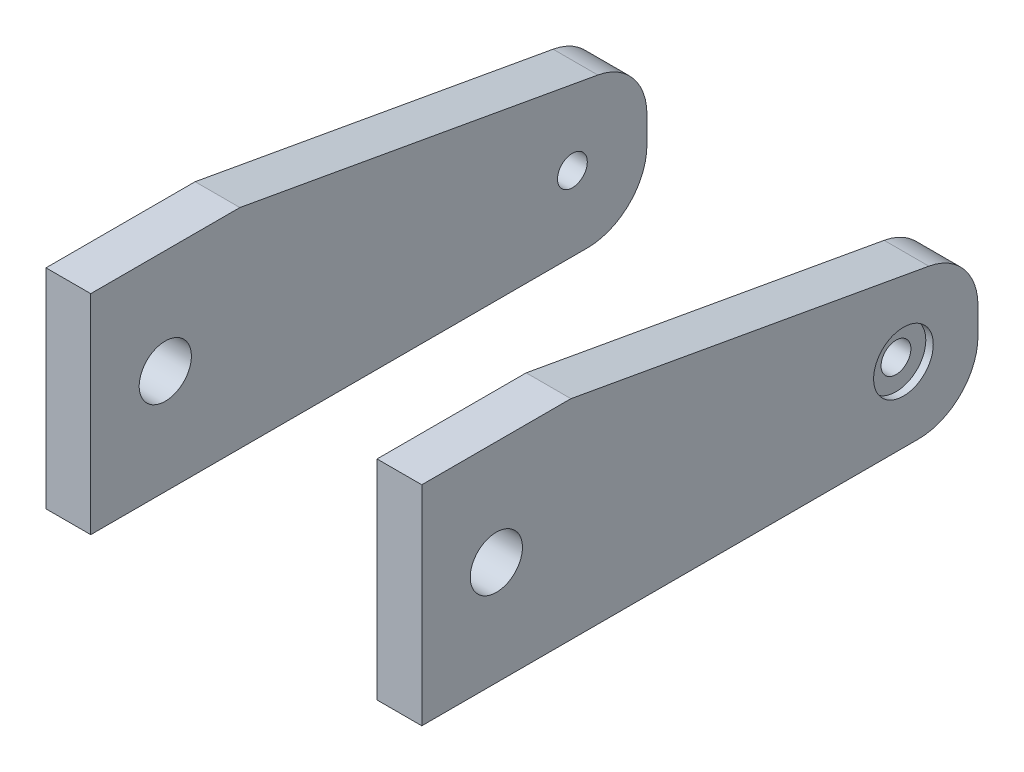
ISO-10303-21;
HEADER;
FILE_DESCRIPTION(('STEP AP214'),'2;1');
FILE_NAME('part.step','',(''),(''),'','','');
FILE_SCHEMA(('AUTOMOTIVE_DESIGN { 1 0 10303 214 1 1 1 1 }'));
ENDSEC;
DATA;
#1=APPLICATION_CONTEXT('core data for automotive mechanical design processes');
#2=APPLICATION_PROTOCOL_DEFINITION('international standard','automotive_design',2000,#1);
#3=PRODUCT_CONTEXT('',#1,'mechanical');
#4=PRODUCT('Part','Part','',(#3));
#5=PRODUCT_RELATED_PRODUCT_CATEGORY('part','',(#4));
#6=PRODUCT_DEFINITION_FORMATION('','',#4);
#7=PRODUCT_DEFINITION_CONTEXT('part definition',#1,'design');
#8=PRODUCT_DEFINITION('design','',#6,#7);
#9=PRODUCT_DEFINITION_SHAPE('','',#8);
#10=(LENGTH_UNIT() NAMED_UNIT(*) SI_UNIT(.MILLI.,.METRE.));
#11=(NAMED_UNIT(*) PLANE_ANGLE_UNIT() SI_UNIT($,.RADIAN.));
#12=(NAMED_UNIT(*) SI_UNIT($,.STERADIAN.) SOLID_ANGLE_UNIT());
#13=UNCERTAINTY_MEASURE_WITH_UNIT(LENGTH_MEASURE(1.E-05),#10,'distance_accuracy_value','');
#14=(GEOMETRIC_REPRESENTATION_CONTEXT(3) GLOBAL_UNCERTAINTY_ASSIGNED_CONTEXT((#13)) GLOBAL_UNIT_ASSIGNED_CONTEXT((#10,
#11,#12)) REPRESENTATION_CONTEXT('',''));
#15=CARTESIAN_POINT('',(0.,0.,0.));
#16=DIRECTION('',(0.,0.,1.));
#17=DIRECTION('',(1.,0.,0.));
#18=AXIS2_PLACEMENT_3D('',#15,#16,#17);
#19=CARTESIAN_POINT('',(-12.6,-6.,0.0233777079188258));
#20=DIRECTION('',(1.,0.,0.));
#21=DIRECTION('',(0.,0.,1.));
#22=AXIS2_PLACEMENT_3D('',#19,#20,#21);
#23=CYLINDRICAL_SURFACE('',#22,1.);
#24=CARTESIAN_POINT('',(-9.6,-6.,0.0233777079188258));
#25=DIRECTION('',(1.,0.,0.));
#26=DIRECTION('',(0.,0.,-1.));
#27=AXIS2_PLACEMENT_3D('',#24,#25,#26);
#28=CIRCLE('',#27,1.);
#29=CARTESIAN_POINT('',(-9.6,-6.,-0.976622292081174));
#30=VERTEX_POINT('',#29);
#31=EDGE_CURVE('E150',#30,#30,#28,.T.);
#32=ORIENTED_EDGE('',*,*,#31,.T.);
#33=EDGE_LOOP('',(#32));
#34=FACE_BOUND('',#33,.T.);
#35=CARTESIAN_POINT('',(-12.1,-6.,0.0233777079188258));
#36=DIRECTION('',(1.,0.,0.));
#37=DIRECTION('',(0.,0.,-1.));
#38=AXIS2_PLACEMENT_3D('',#35,#36,#37);
#39=CIRCLE('',#38,1.);
#40=CARTESIAN_POINT('',(-12.1,-6.,-0.976622292081174));
#41=VERTEX_POINT('',#40);
#42=EDGE_CURVE('E57',#41,#41,#39,.T.);
#43=ORIENTED_EDGE('',*,*,#42,.F.);
#44=EDGE_LOOP('',(#43));
#45=FACE_BOUND('',#44,.T.);
#46=ADVANCED_FACE('F53',(#34,#45),#23,.F.);
#47=CARTESIAN_POINT('',(-12.6,-5.2432115350148,-0.976622292081174));
#48=DIRECTION('',(-1.,0.,0.));
#49=DIRECTION('',(0.,0.,-1.));
#50=AXIS2_PLACEMENT_3D('',#47,#48,#49);
#51=PLANE('',#50);
#52=CARTESIAN_POINT('',(-12.6,-6.,0.0233777079188258));
#53=DIRECTION('',(1.,0.,0.));
#54=DIRECTION('',(0.,0.,-1.));
#55=AXIS2_PLACEMENT_3D('',#52,#53,#54);
#56=CIRCLE('',#55,2.);
#57=CARTESIAN_POINT('',(-12.6,-6.,-1.97662229208117));
#58=VERTEX_POINT('',#57);
#59=EDGE_CURVE('E337',#58,#58,#56,.T.);
#60=ORIENTED_EDGE('',*,*,#59,.T.);
#61=EDGE_LOOP('',(#60));
#62=FACE_BOUND('',#61,.T.);
#63=DIRECTION('',(0.,0.,1.));
#64=VECTOR('',#63,1.);
#65=CARTESIAN_POINT('',(-12.6,3.,32.3233777079188));
#66=LINE('',#65,#64);
#67=CARTESIAN_POINT('',(-12.6,3.,22.3233777079188));
#68=VERTEX_POINT('',#67);
#69=CARTESIAN_POINT('',(-12.6,3.,32.3233777079188));
#70=VERTEX_POINT('',#69);
#71=EDGE_CURVE('E164',#68,#70,#66,.T.);
#72=ORIENTED_EDGE('',*,*,#71,.F.);
#73=DIRECTION('',(0.,0.176554418030412,0.984290880519546));
#74=VECTOR('',#73,1.);
#75=CARTESIAN_POINT('',(-12.6,-1.30604801293662,-1.68283996420282));
#76=LINE('',#75,#74);
#77=CARTESIAN_POINT('',(-12.6,-1.30604801293662,-1.68283996420282));
#78=VERTEX_POINT('',#77);
#79=EDGE_CURVE('E141',#78,#68,#76,.T.);
#80=ORIENTED_EDGE('',*,*,#79,.F.);
#81=CARTESIAN_POINT('',(-12.6,-5.2432115350148,-0.976622292081174));
#82=DIRECTION('',(1.,0.,0.));
#83=DIRECTION('',(0.,0.,-1.));
#84=AXIS2_PLACEMENT_3D('',#81,#82,#83);
#85=CIRCLE('',#84,4.);
#86=CARTESIAN_POINT('',(-12.6,-5.2432115350148,-4.97662229208117));
#87=VERTEX_POINT('',#86);
#88=EDGE_CURVE('E121',#87,#78,#85,.T.);
#89=ORIENTED_EDGE('',*,*,#88,.F.);
#90=DIRECTION('',(0.,1.,0.));
#91=VECTOR('',#90,1.);
#92=CARTESIAN_POINT('',(-12.6,-7.,-4.97662229208118));
#93=LINE('',#92,#91);
#94=CARTESIAN_POINT('',(-12.6,-7.,-4.97662229208118));
#95=VERTEX_POINT('',#94);
#96=EDGE_CURVE('E131',#95,#87,#93,.T.);
#97=ORIENTED_EDGE('',*,*,#96,.F.);
#98=CARTESIAN_POINT('',(-12.6,-7.,-0.976622292081175));
#99=DIRECTION('',(1.,0.,0.));
#100=DIRECTION('',(0.,0.,-1.));
#101=AXIS2_PLACEMENT_3D('',#98,#99,#100);
#102=CIRCLE('',#101,4.);
#103=CARTESIAN_POINT('',(-12.6,-11.,-0.976622292081175));
#104=VERTEX_POINT('',#103);
#105=EDGE_CURVE('E136',#104,#95,#102,.T.);
#106=ORIENTED_EDGE('',*,*,#105,.F.);
#107=DIRECTION('',(0.,0.,-1.));
#108=VECTOR('',#107,1.);
#109=CARTESIAN_POINT('',(-12.6,-11.,22.3233777079188));
#110=LINE('',#109,#108);
#111=CARTESIAN_POINT('',(-12.6,-11.,32.3233777079188));
#112=VERTEX_POINT('',#111);
#113=EDGE_CURVE('E182',#112,#104,#110,.T.);
#114=ORIENTED_EDGE('',*,*,#113,.F.);
#115=DIRECTION('',(0.,-1.,0.));
#116=VECTOR('',#115,1.);
#117=CARTESIAN_POINT('',(-12.6,-11.,32.3233777079188));
#118=LINE('',#117,#116);
#119=EDGE_CURVE('E172',#70,#112,#118,.T.);
#120=ORIENTED_EDGE('',*,*,#119,.F.);
#121=EDGE_LOOP('',(#72,#80,#89,#97,#106,#114,#120));
#122=FACE_BOUND('',#121,.T.);
#123=CARTESIAN_POINT('',(-12.6,-4.,27.3233777079188));
#124=DIRECTION('',(1.,0.,0.));
#125=DIRECTION('',(0.,0.,-1.));
#126=AXIS2_PLACEMENT_3D('',#123,#124,#125);
#127=CIRCLE('',#126,1.75);
#128=CARTESIAN_POINT('',(-12.6,-4.,25.5733777079188));
#129=VERTEX_POINT('',#128);
#130=EDGE_CURVE('E343',#129,#129,#127,.T.);
#131=ORIENTED_EDGE('',*,*,#130,.T.);
#132=EDGE_LOOP('',(#131));
#133=FACE_BOUND('',#132,.T.);
#134=ADVANCED_FACE('F139',(#62,#122,#133),#51,.T.);
#135=CARTESIAN_POINT('',(-9.6,-5.2432115350148,-0.976622292081174));
#136=DIRECTION('',(-1.,0.,0.));
#137=DIRECTION('',(0.,0.,-1.));
#138=AXIS2_PLACEMENT_3D('',#135,#136,#137);
#139=PLANE('',#138);
#140=DIRECTION('',(0.,0.,1.));
#141=VECTOR('',#140,1.);
#142=CARTESIAN_POINT('',(-9.6,3.,32.3233777079188));
#143=LINE('',#142,#141);
#144=CARTESIAN_POINT('',(-9.6,3.,22.3233777079188));
#145=VERTEX_POINT('',#144);
#146=CARTESIAN_POINT('',(-9.6,3.,32.3233777079188));
#147=VERTEX_POINT('',#146);
#148=EDGE_CURVE('E146',#145,#147,#143,.T.);
#149=ORIENTED_EDGE('',*,*,#148,.T.);
#150=DIRECTION('',(0.,-1.,0.));
#151=VECTOR('',#150,1.);
#152=CARTESIAN_POINT('',(-9.6,-11.,32.3233777079188));
#153=LINE('',#152,#151);
#154=CARTESIAN_POINT('',(-9.6,-11.,32.3233777079188));
#155=VERTEX_POINT('',#154);
#156=EDGE_CURVE('E149',#147,#155,#153,.T.);
#157=ORIENTED_EDGE('',*,*,#156,.T.);
#158=DIRECTION('',(0.,0.,-1.));
#159=VECTOR('',#158,1.);
#160=CARTESIAN_POINT('',(-9.6,-11.,22.3233777079188));
#161=LINE('',#160,#159);
#162=CARTESIAN_POINT('',(-9.6,-11.,-0.976622292081175));
#163=VERTEX_POINT('',#162);
#164=EDGE_CURVE('E153',#155,#163,#161,.T.);
#165=ORIENTED_EDGE('',*,*,#164,.T.);
#166=CARTESIAN_POINT('',(-9.6,-7.,-0.976622292081175));
#167=DIRECTION('',(1.,0.,0.));
#168=DIRECTION('',(0.,0.,-1.));
#169=AXIS2_PLACEMENT_3D('',#166,#167,#168);
#170=CIRCLE('',#169,4.);
#171=CARTESIAN_POINT('',(-9.6,-7.,-4.97662229208118));
#172=VERTEX_POINT('',#171);
#173=EDGE_CURVE('E156',#163,#172,#170,.T.);
#174=ORIENTED_EDGE('',*,*,#173,.T.);
#175=DIRECTION('',(0.,1.,0.));
#176=VECTOR('',#175,1.);
#177=CARTESIAN_POINT('',(-9.6,-7.,-4.97662229208118));
#178=LINE('',#177,#176);
#179=CARTESIAN_POINT('',(-9.6,-5.2432115350148,-4.97662229208117));
#180=VERTEX_POINT('',#179);
#181=EDGE_CURVE('E159',#172,#180,#178,.T.);
#182=ORIENTED_EDGE('',*,*,#181,.T.);
#183=CARTESIAN_POINT('',(-9.6,-5.2432115350148,-0.976622292081174));
#184=DIRECTION('',(1.,0.,0.));
#185=DIRECTION('',(0.,0.,-1.));
#186=AXIS2_PLACEMENT_3D('',#183,#184,#185);
#187=CIRCLE('',#186,4.);
#188=CARTESIAN_POINT('',(-9.6,-1.30604801293662,-1.68283996420282));
#189=VERTEX_POINT('',#188);
#190=EDGE_CURVE('E124',#180,#189,#187,.T.);
#191=ORIENTED_EDGE('',*,*,#190,.T.);
#192=DIRECTION('',(0.,0.176554418030412,0.984290880519546));
#193=VECTOR('',#192,1.);
#194=CARTESIAN_POINT('',(-9.6,-1.30604801293662,-1.68283996420282));
#195=LINE('',#194,#193);
#196=EDGE_CURVE('E162',#189,#145,#195,.T.);
#197=ORIENTED_EDGE('',*,*,#196,.T.);
#198=EDGE_LOOP('',(#149,#157,#165,#174,#182,#191,#197));
#199=FACE_BOUND('',#198,.T.);
#200=ORIENTED_EDGE('',*,*,#31,.F.);
#201=EDGE_LOOP('',(#200));
#202=FACE_BOUND('',#201,.T.);
#203=CARTESIAN_POINT('',(-9.6,-4.,27.3233777079188));
#204=DIRECTION('',(1.,0.,0.));
#205=DIRECTION('',(0.,0.,-1.));
#206=AXIS2_PLACEMENT_3D('',#203,#204,#205);
#207=CIRCLE('',#206,1.75);
#208=CARTESIAN_POINT('',(-9.6,-4.,25.5733777079188));
#209=VERTEX_POINT('',#208);
#210=EDGE_CURVE('E339',#209,#209,#207,.T.);
#211=ORIENTED_EDGE('',*,*,#210,.F.);
#212=EDGE_LOOP('',(#211));
#213=FACE_BOUND('',#212,.T.);
#214=ADVANCED_FACE('F179',(#199,#202,#213),#139,.F.);
#215=CARTESIAN_POINT('',(-12.6,3.,32.3233777079188));
#216=DIRECTION('',(0.,-1.,0.));
#217=DIRECTION('',(0.,0.,-1.));
#218=AXIS2_PLACEMENT_3D('',#215,#216,#217);
#219=PLANE('',#218);
#220=ORIENTED_EDGE('',*,*,#148,.F.);
#221=DIRECTION('',(1.,0.,0.));
#222=VECTOR('',#221,1.);
#223=CARTESIAN_POINT('',(-12.6,3.,22.3233777079188));
#224=LINE('',#223,#222);
#225=EDGE_CURVE('E71',#68,#145,#224,.T.);
#226=ORIENTED_EDGE('',*,*,#225,.F.);
#227=ORIENTED_EDGE('',*,*,#71,.T.);
#228=DIRECTION('',(1.,0.,0.));
#229=VECTOR('',#228,1.);
#230=CARTESIAN_POINT('',(-12.6,3.,32.3233777079188));
#231=LINE('',#230,#229);
#232=EDGE_CURVE('E12',#70,#147,#231,.T.);
#233=ORIENTED_EDGE('',*,*,#232,.T.);
#234=EDGE_LOOP('',(#220,#226,#227,#233));
#235=FACE_BOUND('',#234,.T.);
#236=ADVANCED_FACE('F55',(#235),#219,.F.);
#237=CARTESIAN_POINT('',(-12.6,-11.,32.3233777079188));
#238=DIRECTION('',(0.,0.,-1.));
#239=DIRECTION('',(1.,0.,0.));
#240=AXIS2_PLACEMENT_3D('',#237,#238,#239);
#241=PLANE('',#240);
#242=ORIENTED_EDGE('',*,*,#156,.F.);
#243=ORIENTED_EDGE('',*,*,#232,.F.);
#244=ORIENTED_EDGE('',*,*,#119,.T.);
#245=DIRECTION('',(1.,0.,0.));
#246=VECTOR('',#245,1.);
#247=CARTESIAN_POINT('',(-12.6,-11.,32.3233777079188));
#248=LINE('',#247,#246);
#249=EDGE_CURVE('E63',#112,#155,#248,.T.);
#250=ORIENTED_EDGE('',*,*,#249,.T.);
#251=EDGE_LOOP('',(#242,#243,#244,#250));
#252=FACE_BOUND('',#251,.T.);
#253=ADVANCED_FACE('F171',(#252),#241,.F.);
#254=CARTESIAN_POINT('',(-12.6,-11.,22.3233777079188));
#255=DIRECTION('',(0.,1.,0.));
#256=DIRECTION('',(0.,0.,1.));
#257=AXIS2_PLACEMENT_3D('',#254,#255,#256);
#258=PLANE('',#257);
#259=ORIENTED_EDGE('',*,*,#164,.F.);
#260=ORIENTED_EDGE('',*,*,#249,.F.);
#261=ORIENTED_EDGE('',*,*,#113,.T.);
#262=DIRECTION('',(1.,0.,0.));
#263=VECTOR('',#262,1.);
#264=CARTESIAN_POINT('',(-12.6,-11.,-0.976622292081175));
#265=LINE('',#264,#263);
#266=EDGE_CURVE('E168',#104,#163,#265,.T.);
#267=ORIENTED_EDGE('',*,*,#266,.T.);
#268=EDGE_LOOP('',(#259,#260,#261,#267));
#269=FACE_BOUND('',#268,.T.);
#270=ADVANCED_FACE('F176',(#269),#258,.F.);
#271=CARTESIAN_POINT('',(-12.6,-7.,-0.976622292081175));
#272=DIRECTION('',(1.,0.,0.));
#273=DIRECTION('',(0.,0.,1.));
#274=AXIS2_PLACEMENT_3D('',#271,#272,#273);
#275=CYLINDRICAL_SURFACE('',#274,4.);
#276=ORIENTED_EDGE('',*,*,#173,.F.);
#277=ORIENTED_EDGE('',*,*,#266,.F.);
#278=ORIENTED_EDGE('',*,*,#105,.T.);
#279=DIRECTION('',(1.,0.,0.));
#280=VECTOR('',#279,1.);
#281=CARTESIAN_POINT('',(-12.6,-7.,-4.97662229208118));
#282=LINE('',#281,#280);
#283=EDGE_CURVE('E128',#95,#172,#282,.T.);
#284=ORIENTED_EDGE('',*,*,#283,.T.);
#285=EDGE_LOOP('',(#276,#277,#278,#284));
#286=FACE_BOUND('',#285,.T.);
#287=ADVANCED_FACE('F188',(#286),#275,.T.);
#288=CARTESIAN_POINT('',(-12.6,-7.,-4.97662229208118));
#289=DIRECTION('',(0.,0.,1.));
#290=DIRECTION('',(0.,-1.,0.));
#291=AXIS2_PLACEMENT_3D('',#288,#289,#290);
#292=PLANE('',#291);
#293=ORIENTED_EDGE('',*,*,#181,.F.);
#294=ORIENTED_EDGE('',*,*,#283,.F.);
#295=ORIENTED_EDGE('',*,*,#96,.T.);
#296=DIRECTION('',(1.,0.,0.));
#297=VECTOR('',#296,1.);
#298=CARTESIAN_POINT('',(-12.6,-5.2432115350148,-4.97662229208117));
#299=LINE('',#298,#297);
#300=EDGE_CURVE('E117',#87,#180,#299,.T.);
#301=ORIENTED_EDGE('',*,*,#300,.T.);
#302=EDGE_LOOP('',(#293,#294,#295,#301));
#303=FACE_BOUND('',#302,.T.);
#304=ADVANCED_FACE('F132',(#303),#292,.F.);
#305=CARTESIAN_POINT('',(-12.6,-5.2432115350148,-0.976622292081174));
#306=DIRECTION('',(1.,0.,0.));
#307=DIRECTION('',(0.,0.,1.));
#308=AXIS2_PLACEMENT_3D('',#305,#306,#307);
#309=CYLINDRICAL_SURFACE('',#308,4.);
#310=ORIENTED_EDGE('',*,*,#190,.F.);
#311=ORIENTED_EDGE('',*,*,#300,.F.);
#312=ORIENTED_EDGE('',*,*,#88,.T.);
#313=DIRECTION('',(1.,0.,0.));
#314=VECTOR('',#313,1.);
#315=CARTESIAN_POINT('',(-12.6,-1.30604801293662,-1.68283996420282));
#316=LINE('',#315,#314);
#317=EDGE_CURVE('E96',#78,#189,#316,.T.);
#318=ORIENTED_EDGE('',*,*,#317,.T.);
#319=EDGE_LOOP('',(#310,#311,#312,#318));
#320=FACE_BOUND('',#319,.T.);
#321=ADVANCED_FACE('F119',(#320),#309,.T.);
#322=CARTESIAN_POINT('',(-12.6,-1.30604801293662,-1.68283996420282));
#323=DIRECTION('',(0.,-0.984290880519546,0.176554418030412));
#324=DIRECTION('',(0.,-0.176554418030412,-0.984290880519546));
#325=AXIS2_PLACEMENT_3D('',#322,#323,#324);
#326=PLANE('',#325);
#327=ORIENTED_EDGE('',*,*,#196,.F.);
#328=ORIENTED_EDGE('',*,*,#317,.F.);
#329=ORIENTED_EDGE('',*,*,#79,.T.);
#330=ORIENTED_EDGE('',*,*,#225,.T.);
#331=EDGE_LOOP('',(#327,#328,#329,#330));
#332=FACE_BOUND('',#331,.T.);
#333=ADVANCED_FACE('F213',(#332),#326,.F.);
#334=CARTESIAN_POINT('',(-12.6,-4.,27.3233777079188));
#335=DIRECTION('',(1.,0.,0.));
#336=DIRECTION('',(0.,0.,1.));
#337=AXIS2_PLACEMENT_3D('',#334,#335,#336);
#338=CYLINDRICAL_SURFACE('',#337,1.75);
#339=ORIENTED_EDGE('',*,*,#130,.F.);
#340=EDGE_LOOP('',(#339));
#341=FACE_BOUND('',#340,.T.);
#342=ORIENTED_EDGE('',*,*,#210,.T.);
#343=EDGE_LOOP('',(#342));
#344=FACE_BOUND('',#343,.T.);
#345=ADVANCED_FACE('F208',(#341,#344),#338,.F.);
#346=CARTESIAN_POINT('',(-12.1,-6.,0.0233777079188258));
#347=DIRECTION('',(-1.,0.,0.));
#348=DIRECTION('',(0.,0.,-1.));
#349=AXIS2_PLACEMENT_3D('',#346,#347,#348);
#350=CYLINDRICAL_SURFACE('',#349,2.);
#351=CARTESIAN_POINT('',(-12.1,-6.,0.0233777079188258));
#352=DIRECTION('',(1.,0.,0.));
#353=DIRECTION('',(0.,0.,-1.));
#354=AXIS2_PLACEMENT_3D('',#351,#352,#353);
#355=CIRCLE('',#354,2.);
#356=CARTESIAN_POINT('',(-12.1,-6.,-1.97662229208117));
#357=VERTEX_POINT('',#356);
#358=EDGE_CURVE('E336',#357,#357,#355,.T.);
#359=ORIENTED_EDGE('',*,*,#358,.T.);
#360=EDGE_LOOP('',(#359));
#361=FACE_BOUND('',#360,.T.);
#362=ORIENTED_EDGE('',*,*,#59,.F.);
#363=EDGE_LOOP('',(#362));
#364=FACE_BOUND('',#363,.T.);
#365=ADVANCED_FACE('F231',(#361,#364),#350,.F.);
#366=CARTESIAN_POINT('',(-12.1,-6.,0.0233777079188258));
#367=DIRECTION('',(-1.,0.,0.));
#368=DIRECTION('',(0.,0.,-1.));
#369=AXIS2_PLACEMENT_3D('',#366,#367,#368);
#370=PLANE('',#369);
#371=ORIENTED_EDGE('',*,*,#42,.T.);
#372=EDGE_LOOP('',(#371));
#373=FACE_BOUND('',#372,.T.);
#374=ORIENTED_EDGE('',*,*,#358,.F.);
#375=EDGE_LOOP('',(#374));
#376=FACE_BOUND('',#375,.T.);
#377=ADVANCED_FACE('F238',(#373,#376),#370,.T.);
#378=CLOSED_SHELL('',(#46,#134,#214,#236,#253,#270,#287,#304,#321,#333,#345,#365,#377));
#379=MANIFOLD_SOLID_BREP('B2',#378);
#380=CARTESIAN_POINT('',(12.6,-6.,0.0233777079188258));
#381=DIRECTION('',(-1.,0.,0.));
#382=DIRECTION('',(0.,0.,1.));
#383=AXIS2_PLACEMENT_3D('',#380,#381,#382);
#384=CYLINDRICAL_SURFACE('',#383,1.);
#385=CARTESIAN_POINT('',(9.6,-6.,0.0233777079188258));
#386=DIRECTION('',(1.,0.,0.));
#387=DIRECTION('',(0.,0.,-1.));
#388=AXIS2_PLACEMENT_3D('',#385,#386,#387);
#389=CIRCLE('',#388,1.);
#390=CARTESIAN_POINT('',(9.6,-6.,-0.976622292081174));
#391=VERTEX_POINT('',#390);
#392=EDGE_CURVE('E459',#391,#391,#389,.T.);
#393=ORIENTED_EDGE('',*,*,#392,.F.);
#394=EDGE_LOOP('',(#393));
#395=FACE_BOUND('',#394,.T.);
#396=CARTESIAN_POINT('',(12.1,-6.,0.0233777079188258));
#397=DIRECTION('',(1.,0.,0.));
#398=DIRECTION('',(0.,0.,-1.));
#399=AXIS2_PLACEMENT_3D('',#396,#397,#398);
#400=CIRCLE('',#399,1.);
#401=CARTESIAN_POINT('',(12.1,-6.,-0.976622292081174));
#402=VERTEX_POINT('',#401);
#403=EDGE_CURVE('E360',#402,#402,#400,.T.);
#404=ORIENTED_EDGE('',*,*,#403,.T.);
#405=EDGE_LOOP('',(#404));
#406=FACE_BOUND('',#405,.T.);
#407=ADVANCED_FACE('F356',(#395,#406),#384,.F.);
#408=CARTESIAN_POINT('',(12.6,-5.2432115350148,-0.976622292081174));
#409=DIRECTION('',(1.,0.,0.));
#410=DIRECTION('',(0.,0.,-1.));
#411=AXIS2_PLACEMENT_3D('',#408,#409,#410);
#412=PLANE('',#411);
#413=CARTESIAN_POINT('',(12.6,-6.,0.0233777079188258));
#414=DIRECTION('',(1.,0.,0.));
#415=DIRECTION('',(0.,0.,-1.));
#416=AXIS2_PLACEMENT_3D('',#413,#414,#415);
#417=CIRCLE('',#416,2.);
#418=CARTESIAN_POINT('',(12.6,-6.,-1.97662229208117));
#419=VERTEX_POINT('',#418);
#420=EDGE_CURVE('E521',#419,#419,#417,.T.);
#421=ORIENTED_EDGE('',*,*,#420,.F.);
#422=EDGE_LOOP('',(#421));
#423=FACE_BOUND('',#422,.T.);
#424=DIRECTION('',(0.,0.,1.));
#425=VECTOR('',#424,1.);
#426=CARTESIAN_POINT('',(12.6,3.,32.3233777079188));
#427=LINE('',#426,#425);
#428=CARTESIAN_POINT('',(12.6,3.,22.3233777079188));
#429=VERTEX_POINT('',#428);
#430=CARTESIAN_POINT('',(12.6,3.,32.3233777079188));
#431=VERTEX_POINT('',#430);
#432=EDGE_CURVE('E475',#429,#431,#427,.T.);
#433=ORIENTED_EDGE('',*,*,#432,.T.);
#434=DIRECTION('',(0.,-1.,0.));
#435=VECTOR('',#434,1.);
#436=CARTESIAN_POINT('',(12.6,-11.,32.3233777079188));
#437=LINE('',#436,#435);
#438=CARTESIAN_POINT('',(12.6,-11.,32.3233777079188));
#439=VERTEX_POINT('',#438);
#440=EDGE_CURVE('E415',#431,#439,#437,.T.);
#441=ORIENTED_EDGE('',*,*,#440,.T.);
#442=DIRECTION('',(0.,0.,-1.));
#443=VECTOR('',#442,1.);
#444=CARTESIAN_POINT('',(12.6,-11.,22.3233777079188));
#445=LINE('',#444,#443);
#446=CARTESIAN_POINT('',(12.6,-11.,-0.976622292081175));
#447=VERTEX_POINT('',#446);
#448=EDGE_CURVE('E492',#439,#447,#445,.T.);
#449=ORIENTED_EDGE('',*,*,#448,.T.);
#450=CARTESIAN_POINT('',(12.6,-7.,-0.976622292081175));
#451=DIRECTION('',(1.,0.,0.));
#452=DIRECTION('',(0.,0.,-1.));
#453=AXIS2_PLACEMENT_3D('',#450,#451,#452);
#454=CIRCLE('',#453,4.);
#455=CARTESIAN_POINT('',(12.6,-7.,-4.97662229208118));
#456=VERTEX_POINT('',#455);
#457=EDGE_CURVE('E432',#447,#456,#454,.T.);
#458=ORIENTED_EDGE('',*,*,#457,.T.);
#459=DIRECTION('',(0.,1.,0.));
#460=VECTOR('',#459,1.);
#461=CARTESIAN_POINT('',(12.6,-7.,-4.97662229208118));
#462=LINE('',#461,#460);
#463=CARTESIAN_POINT('',(12.6,-5.2432115350148,-4.97662229208117));
#464=VERTEX_POINT('',#463);
#465=EDGE_CURVE('E425',#456,#464,#462,.T.);
#466=ORIENTED_EDGE('',*,*,#465,.T.);
#467=CARTESIAN_POINT('',(12.6,-5.2432115350148,-0.976622292081174));
#468=DIRECTION('',(1.,0.,0.));
#469=DIRECTION('',(0.,0.,-1.));
#470=AXIS2_PLACEMENT_3D('',#467,#468,#469);
#471=CIRCLE('',#470,4.);
#472=CARTESIAN_POINT('',(12.6,-1.30604801293662,-1.68283996420282));
#473=VERTEX_POINT('',#472);
#474=EDGE_CURVE('E430',#464,#473,#471,.T.);
#475=ORIENTED_EDGE('',*,*,#474,.T.);
#476=DIRECTION('',(0.,0.176554418030412,0.984290880519546));
#477=VECTOR('',#476,1.);
#478=CARTESIAN_POINT('',(12.6,-1.30604801293662,-1.68283996420282));
#479=LINE('',#478,#477);
#480=EDGE_CURVE('E375',#473,#429,#479,.T.);
#481=ORIENTED_EDGE('',*,*,#480,.T.);
#482=EDGE_LOOP('',(#433,#441,#449,#458,#466,#475,#481));
#483=FACE_BOUND('',#482,.T.);
#484=CARTESIAN_POINT('',(12.6,-4.,27.3233777079188));
#485=DIRECTION('',(1.,0.,0.));
#486=DIRECTION('',(0.,0.,-1.));
#487=AXIS2_PLACEMENT_3D('',#484,#485,#486);
#488=CIRCLE('',#487,1.75);
#489=CARTESIAN_POINT('',(12.6,-4.,25.5733777079188));
#490=VERTEX_POINT('',#489);
#491=EDGE_CURVE('E513',#490,#490,#488,.T.);
#492=ORIENTED_EDGE('',*,*,#491,.F.);
#493=EDGE_LOOP('',(#492));
#494=FACE_BOUND('',#493,.T.);
#495=ADVANCED_FACE('F427',(#423,#483,#494),#412,.T.);
#496=CARTESIAN_POINT('',(9.6,-5.2432115350148,-0.976622292081174));
#497=DIRECTION('',(1.,0.,0.));
#498=DIRECTION('',(0.,0.,-1.));
#499=AXIS2_PLACEMENT_3D('',#496,#497,#498);
#500=PLANE('',#499);
#501=DIRECTION('',(0.,0.,1.));
#502=VECTOR('',#501,1.);
#503=CARTESIAN_POINT('',(9.6,3.,32.3233777079188));
#504=LINE('',#503,#502);
#505=CARTESIAN_POINT('',(9.6,3.,22.3233777079188));
#506=VERTEX_POINT('',#505);
#507=CARTESIAN_POINT('',(9.6,3.,32.3233777079188));
#508=VERTEX_POINT('',#507);
#509=EDGE_CURVE('E454',#506,#508,#504,.T.);
#510=ORIENTED_EDGE('',*,*,#509,.F.);
#511=DIRECTION('',(0.,0.176554418030412,0.984290880519546));
#512=VECTOR('',#511,1.);
#513=CARTESIAN_POINT('',(9.6,-1.30604801293662,-1.68283996420282));
#514=LINE('',#513,#512);
#515=CARTESIAN_POINT('',(9.6,-1.30604801293662,-1.68283996420282));
#516=VERTEX_POINT('',#515);
#517=EDGE_CURVE('E407',#516,#506,#514,.T.);
#518=ORIENTED_EDGE('',*,*,#517,.F.);
#519=CARTESIAN_POINT('',(9.6,-5.2432115350148,-0.976622292081174));
#520=DIRECTION('',(1.,0.,0.));
#521=DIRECTION('',(0.,0.,-1.));
#522=AXIS2_PLACEMENT_3D('',#519,#520,#521);
#523=CIRCLE('',#522,4.);
#524=CARTESIAN_POINT('',(9.6,-5.2432115350148,-4.97662229208117));
#525=VERTEX_POINT('',#524);
#526=EDGE_CURVE('E401',#525,#516,#523,.T.);
#527=ORIENTED_EDGE('',*,*,#526,.F.);
#528=DIRECTION('',(0.,1.,0.));
#529=VECTOR('',#528,1.);
#530=CARTESIAN_POINT('',(9.6,-7.,-4.97662229208118));
#531=LINE('',#530,#529);
#532=CARTESIAN_POINT('',(9.6,-7.,-4.97662229208118));
#533=VERTEX_POINT('',#532);
#534=EDGE_CURVE('E441',#533,#525,#531,.T.);
#535=ORIENTED_EDGE('',*,*,#534,.F.);
#536=CARTESIAN_POINT('',(9.6,-7.,-0.976622292081175));
#537=DIRECTION('',(1.,0.,0.));
#538=DIRECTION('',(0.,0.,-1.));
#539=AXIS2_PLACEMENT_3D('',#536,#537,#538);
#540=CIRCLE('',#539,4.);
#541=CARTESIAN_POINT('',(9.6,-11.,-0.976622292081175));
#542=VERTEX_POINT('',#541);
#543=EDGE_CURVE('E466',#542,#533,#540,.T.);
#544=ORIENTED_EDGE('',*,*,#543,.F.);
#545=DIRECTION('',(0.,0.,-1.));
#546=VECTOR('',#545,1.);
#547=CARTESIAN_POINT('',(9.6,-11.,22.3233777079188));
#548=LINE('',#547,#546);
#549=CARTESIAN_POINT('',(9.6,-11.,32.3233777079188));
#550=VERTEX_POINT('',#549);
#551=EDGE_CURVE('E463',#550,#542,#548,.T.);
#552=ORIENTED_EDGE('',*,*,#551,.F.);
#553=DIRECTION('',(0.,-1.,0.));
#554=VECTOR('',#553,1.);
#555=CARTESIAN_POINT('',(9.6,-11.,32.3233777079188));
#556=LINE('',#555,#554);
#557=EDGE_CURVE('E458',#508,#550,#556,.T.);
#558=ORIENTED_EDGE('',*,*,#557,.F.);
#559=EDGE_LOOP('',(#510,#518,#527,#535,#544,#552,#558));
#560=FACE_BOUND('',#559,.T.);
#561=ORIENTED_EDGE('',*,*,#392,.T.);
#562=EDGE_LOOP('',(#561));
#563=FACE_BOUND('',#562,.T.);
#564=CARTESIAN_POINT('',(9.6,-4.,27.3233777079188));
#565=DIRECTION('',(1.,0.,0.));
#566=DIRECTION('',(0.,0.,-1.));
#567=AXIS2_PLACEMENT_3D('',#564,#565,#566);
#568=CIRCLE('',#567,1.75);
#569=CARTESIAN_POINT('',(9.6,-4.,25.5733777079188));
#570=VERTEX_POINT('',#569);
#571=EDGE_CURVE('E514',#570,#570,#568,.T.);
#572=ORIENTED_EDGE('',*,*,#571,.T.);
#573=EDGE_LOOP('',(#572));
#574=FACE_BOUND('',#573,.T.);
#575=ADVANCED_FACE('F497',(#560,#563,#574),#500,.F.);
#576=CARTESIAN_POINT('',(12.6,3.,32.3233777079188));
#577=DIRECTION('',(0.,-1.,0.));
#578=DIRECTION('',(0.,0.,-1.));
#579=AXIS2_PLACEMENT_3D('',#576,#577,#578);
#580=PLANE('',#579);
#581=ORIENTED_EDGE('',*,*,#509,.T.);
#582=DIRECTION('',(-1.,0.,0.));
#583=VECTOR('',#582,1.);
#584=CARTESIAN_POINT('',(12.6,3.,32.3233777079188));
#585=LINE('',#584,#583);
#586=EDGE_CURVE('E51',#431,#508,#585,.T.);
#587=ORIENTED_EDGE('',*,*,#586,.F.);
#588=ORIENTED_EDGE('',*,*,#432,.F.);
#589=DIRECTION('',(-1.,0.,0.));
#590=VECTOR('',#589,1.);
#591=CARTESIAN_POINT('',(12.6,3.,22.3233777079188));
#592=LINE('',#591,#590);
#593=EDGE_CURVE('E450',#429,#506,#592,.T.);
#594=ORIENTED_EDGE('',*,*,#593,.T.);
#595=EDGE_LOOP('',(#581,#587,#588,#594));
#596=FACE_BOUND('',#595,.T.);
#597=ADVANCED_FACE('F358',(#596),#580,.F.);
#598=CARTESIAN_POINT('',(12.6,-11.,32.3233777079188));
#599=DIRECTION('',(0.,0.,-1.));
#600=DIRECTION('',(-1.,0.,0.));
#601=AXIS2_PLACEMENT_3D('',#598,#599,#600);
#602=PLANE('',#601);
#603=ORIENTED_EDGE('',*,*,#557,.T.);
#604=DIRECTION('',(-1.,0.,0.));
#605=VECTOR('',#604,1.);
#606=CARTESIAN_POINT('',(12.6,-11.,32.3233777079188));
#607=LINE('',#606,#605);
#608=EDGE_CURVE('E367',#439,#550,#607,.T.);
#609=ORIENTED_EDGE('',*,*,#608,.F.);
#610=ORIENTED_EDGE('',*,*,#440,.F.);
#611=ORIENTED_EDGE('',*,*,#586,.T.);
#612=EDGE_LOOP('',(#603,#609,#610,#611));
#613=FACE_BOUND('',#612,.T.);
#614=ADVANCED_FACE('F493',(#613),#602,.F.);
#615=CARTESIAN_POINT('',(12.6,-11.,22.3233777079188));
#616=DIRECTION('',(0.,1.,0.));
#617=DIRECTION('',(0.,0.,1.));
#618=AXIS2_PLACEMENT_3D('',#615,#616,#617);
#619=PLANE('',#618);
#620=ORIENTED_EDGE('',*,*,#551,.T.);
#621=DIRECTION('',(-1.,0.,0.));
#622=VECTOR('',#621,1.);
#623=CARTESIAN_POINT('',(12.6,-11.,-0.976622292081175));
#624=LINE('',#623,#622);
#625=EDGE_CURVE('E482',#447,#542,#624,.T.);
#626=ORIENTED_EDGE('',*,*,#625,.F.);
#627=ORIENTED_EDGE('',*,*,#448,.F.);
#628=ORIENTED_EDGE('',*,*,#608,.T.);
#629=EDGE_LOOP('',(#620,#626,#627,#628));
#630=FACE_BOUND('',#629,.T.);
#631=ADVANCED_FACE('F490',(#630),#619,.F.);
#632=CARTESIAN_POINT('',(12.6,-7.,-0.976622292081175));
#633=DIRECTION('',(-1.,0.,0.));
#634=DIRECTION('',(0.,0.,1.));
#635=AXIS2_PLACEMENT_3D('',#632,#633,#634);
#636=CYLINDRICAL_SURFACE('',#635,4.);
#637=ORIENTED_EDGE('',*,*,#543,.T.);
#638=DIRECTION('',(-1.,0.,0.));
#639=VECTOR('',#638,1.);
#640=CARTESIAN_POINT('',(12.6,-7.,-4.97662229208118));
#641=LINE('',#640,#639);
#642=EDGE_CURVE('E443',#456,#533,#641,.T.);
#643=ORIENTED_EDGE('',*,*,#642,.F.);
#644=ORIENTED_EDGE('',*,*,#457,.F.);
#645=ORIENTED_EDGE('',*,*,#625,.T.);
#646=EDGE_LOOP('',(#637,#643,#644,#645));
#647=FACE_BOUND('',#646,.T.);
#648=ADVANCED_FACE('F501',(#647),#636,.T.);
#649=CARTESIAN_POINT('',(12.6,-7.,-4.97662229208118));
#650=DIRECTION('',(0.,0.,1.));
#651=DIRECTION('',(0.,-1.,0.));
#652=AXIS2_PLACEMENT_3D('',#649,#650,#651);
#653=PLANE('',#652);
#654=ORIENTED_EDGE('',*,*,#534,.T.);
#655=DIRECTION('',(-1.,0.,0.));
#656=VECTOR('',#655,1.);
#657=CARTESIAN_POINT('',(12.6,-5.2432115350148,-4.97662229208117));
#658=LINE('',#657,#656);
#659=EDGE_CURVE('E438',#464,#525,#658,.T.);
#660=ORIENTED_EDGE('',*,*,#659,.F.);
#661=ORIENTED_EDGE('',*,*,#465,.F.);
#662=ORIENTED_EDGE('',*,*,#642,.T.);
#663=EDGE_LOOP('',(#654,#660,#661,#662));
#664=FACE_BOUND('',#663,.T.);
#665=ADVANCED_FACE('F439',(#664),#653,.F.);
#666=CARTESIAN_POINT('',(12.6,-5.2432115350148,-0.976622292081174));
#667=DIRECTION('',(-1.,0.,0.));
#668=DIRECTION('',(0.,0.,1.));
#669=AXIS2_PLACEMENT_3D('',#666,#667,#668);
#670=CYLINDRICAL_SURFACE('',#669,4.);
#671=ORIENTED_EDGE('',*,*,#526,.T.);
#672=DIRECTION('',(-1.,0.,0.));
#673=VECTOR('',#672,1.);
#674=CARTESIAN_POINT('',(12.6,-1.30604801293662,-1.68283996420282));
#675=LINE('',#674,#673);
#676=EDGE_CURVE('E444',#473,#516,#675,.T.);
#677=ORIENTED_EDGE('',*,*,#676,.F.);
#678=ORIENTED_EDGE('',*,*,#474,.F.);
#679=ORIENTED_EDGE('',*,*,#659,.T.);
#680=EDGE_LOOP('',(#671,#677,#678,#679));
#681=FACE_BOUND('',#680,.T.);
#682=ADVANCED_FACE('F446',(#681),#670,.T.);
#683=CARTESIAN_POINT('',(12.6,-1.30604801293662,-1.68283996420282));
#684=DIRECTION('',(0.,-0.984290880519546,0.176554418030412));
#685=DIRECTION('',(0.,-0.176554418030412,-0.984290880519546));
#686=AXIS2_PLACEMENT_3D('',#683,#684,#685);
#687=PLANE('',#686);
#688=ORIENTED_EDGE('',*,*,#517,.T.);
#689=ORIENTED_EDGE('',*,*,#593,.F.);
#690=ORIENTED_EDGE('',*,*,#480,.F.);
#691=ORIENTED_EDGE('',*,*,#676,.T.);
#692=EDGE_LOOP('',(#688,#689,#690,#691));
#693=FACE_BOUND('',#692,.T.);
#694=ADVANCED_FACE('F558',(#693),#687,.F.);
#695=CARTESIAN_POINT('',(12.6,-4.,27.3233777079188));
#696=DIRECTION('',(-1.,0.,0.));
#697=DIRECTION('',(0.,0.,1.));
#698=AXIS2_PLACEMENT_3D('',#695,#696,#697);
#699=CYLINDRICAL_SURFACE('',#698,1.75);
#700=ORIENTED_EDGE('',*,*,#491,.T.);
#701=EDGE_LOOP('',(#700));
#702=FACE_BOUND('',#701,.T.);
#703=ORIENTED_EDGE('',*,*,#571,.F.);
#704=EDGE_LOOP('',(#703));
#705=FACE_BOUND('',#704,.T.);
#706=ADVANCED_FACE('F542',(#702,#705),#699,.F.);
#707=CARTESIAN_POINT('',(12.1,-6.,0.0233777079188258));
#708=DIRECTION('',(1.,0.,0.));
#709=DIRECTION('',(0.,0.,-1.));
#710=AXIS2_PLACEMENT_3D('',#707,#708,#709);
#711=CYLINDRICAL_SURFACE('',#710,2.);
#712=CARTESIAN_POINT('',(12.1,-6.,0.0233777079188258));
#713=DIRECTION('',(1.,0.,0.));
#714=DIRECTION('',(0.,0.,-1.));
#715=AXIS2_PLACEMENT_3D('',#712,#713,#714);
#716=CIRCLE('',#715,2.);
#717=CARTESIAN_POINT('',(12.1,-6.,-1.97662229208117));
#718=VERTEX_POINT('',#717);
#719=EDGE_CURVE('E525',#718,#718,#716,.T.);
#720=ORIENTED_EDGE('',*,*,#719,.F.);
#721=EDGE_LOOP('',(#720));
#722=FACE_BOUND('',#721,.T.);
#723=ORIENTED_EDGE('',*,*,#420,.T.);
#724=EDGE_LOOP('',(#723));
#725=FACE_BOUND('',#724,.T.);
#726=ADVANCED_FACE('F537',(#722,#725),#711,.F.);
#727=CARTESIAN_POINT('',(12.1,-6.,0.0233777079188258));
#728=DIRECTION('',(1.,0.,0.));
#729=DIRECTION('',(0.,0.,-1.));
#730=AXIS2_PLACEMENT_3D('',#727,#728,#729);
#731=PLANE('',#730);
#732=ORIENTED_EDGE('',*,*,#403,.F.);
#733=EDGE_LOOP('',(#732));
#734=FACE_BOUND('',#733,.T.);
#735=ORIENTED_EDGE('',*,*,#719,.T.);
#736=EDGE_LOOP('',(#735));
#737=FACE_BOUND('',#736,.T.);
#738=ADVANCED_FACE('F535',(#734,#737),#731,.T.);
#739=CLOSED_SHELL('',(#407,#495,#575,#597,#614,#631,#648,#665,#682,#694,#706,#726,#738));
#740=MANIFOLD_SOLID_BREP('B6',#739);
#741=ADVANCED_BREP_SHAPE_REPRESENTATION('',(#18,#379,#740),#14);
#742=SHAPE_DEFINITION_REPRESENTATION(#9,#741);
ENDSEC;
END-ISO-10303-21;
